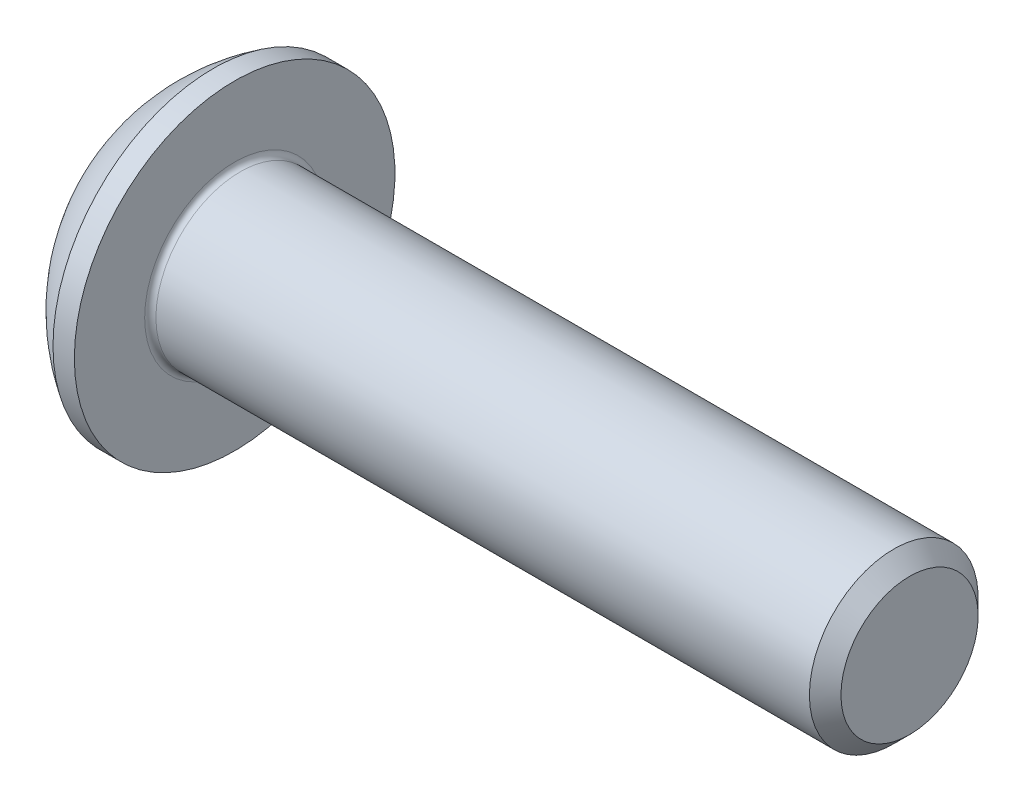
ISO-10303-21;
HEADER;
FILE_DESCRIPTION(('STEP AP214'),'2;1');
FILE_NAME('part.step','',(''),(''),'','','');
FILE_SCHEMA(('AUTOMOTIVE_DESIGN { 1 0 10303 214 1 1 1 1 }'));
ENDSEC;
DATA;
#1=APPLICATION_CONTEXT('core data for automotive mechanical design processes');
#2=APPLICATION_PROTOCOL_DEFINITION('international standard','automotive_design',2000,#1);
#3=PRODUCT_CONTEXT('',#1,'mechanical');
#4=PRODUCT('Part','Part','',(#3));
#5=PRODUCT_RELATED_PRODUCT_CATEGORY('part','',(#4));
#6=PRODUCT_DEFINITION_FORMATION('','',#4);
#7=PRODUCT_DEFINITION_CONTEXT('part definition',#1,'design');
#8=PRODUCT_DEFINITION('design','',#6,#7);
#9=PRODUCT_DEFINITION_SHAPE('','',#8);
#10=(LENGTH_UNIT() NAMED_UNIT(*) SI_UNIT(.MILLI.,.METRE.));
#11=(NAMED_UNIT(*) PLANE_ANGLE_UNIT() SI_UNIT($,.RADIAN.));
#12=(NAMED_UNIT(*) SI_UNIT($,.STERADIAN.) SOLID_ANGLE_UNIT());
#13=UNCERTAINTY_MEASURE_WITH_UNIT(LENGTH_MEASURE(1.E-05),#10,'distance_accuracy_value','');
#14=(GEOMETRIC_REPRESENTATION_CONTEXT(3) GLOBAL_UNCERTAINTY_ASSIGNED_CONTEXT((#13)) GLOBAL_UNIT_ASSIGNED_CONTEXT((#10,
#11,#12)) REPRESENTATION_CONTEXT('',''));
#15=CARTESIAN_POINT('',(0.,0.,0.));
#16=DIRECTION('',(0.,0.,1.));
#17=DIRECTION('',(1.,0.,0.));
#18=AXIS2_PLACEMENT_3D('',#15,#16,#17);
#19=CARTESIAN_POINT('',(0.,0.,0.));
#20=DIRECTION('',(-1.,0.,0.));
#21=DIRECTION('',(0.,0.,1.));
#22=AXIS2_PLACEMENT_3D('',#19,#20,#21);
#23=PLANE('',#22);
#24=CARTESIAN_POINT('',(0.,0.,0.));
#25=DIRECTION('',(-1.,0.,0.));
#26=DIRECTION('',(0.,0.,1.));
#27=AXIS2_PLACEMENT_3D('',#24,#25,#26);
#28=CIRCLE('',#27,1.425);
#29=CARTESIAN_POINT('',(0.,0.,1.425));
#30=VERTEX_POINT('',#29);
#31=EDGE_CURVE('E153',#30,#30,#28,.T.);
#32=ORIENTED_EDGE('',*,*,#31,.T.);
#33=EDGE_LOOP('',(#32));
#34=FACE_BOUND('',#33,.T.);
#35=DIRECTION('',(0.,-1.,0.));
#36=VECTOR('',#35,1.);
#37=CARTESIAN_POINT('',(0.,-0.577350269189625,0.999999999999998));
#38=LINE('',#37,#36);
#39=CARTESIAN_POINT('',(0.,0.577350269189628,1.));
#40=VERTEX_POINT('',#39);
#41=CARTESIAN_POINT('',(0.,-0.577350269189625,0.999999999999998));
#42=VERTEX_POINT('',#41);
#43=EDGE_CURVE('E48',#40,#42,#38,.T.);
#44=ORIENTED_EDGE('',*,*,#43,.T.);
#45=DIRECTION('',(0.,-0.499999999999999,-0.866025403784439));
#46=VECTOR('',#45,1.);
#47=CARTESIAN_POINT('',(0.,-1.15470053837925,0.));
#48=LINE('',#47,#46);
#49=CARTESIAN_POINT('',(0.,-1.15470053837925,0.));
#50=VERTEX_POINT('',#49);
#51=EDGE_CURVE('E273',#42,#50,#48,.T.);
#52=ORIENTED_EDGE('',*,*,#51,.T.);
#53=DIRECTION('',(0.,0.499999999999997,-0.86602540378444));
#54=VECTOR('',#53,1.);
#55=CARTESIAN_POINT('',(0.,-0.577350269189626,-1.));
#56=LINE('',#55,#54);
#57=CARTESIAN_POINT('',(0.,-0.577350269189626,-1.));
#58=VERTEX_POINT('',#57);
#59=EDGE_CURVE('E128',#50,#58,#56,.T.);
#60=ORIENTED_EDGE('',*,*,#59,.T.);
#61=DIRECTION('',(0.,1.,0.));
#62=VECTOR('',#61,1.);
#63=CARTESIAN_POINT('',(0.,0.577350269189628,-1.));
#64=LINE('',#63,#62);
#65=CARTESIAN_POINT('',(0.,0.577350269189628,-1.));
#66=VERTEX_POINT('',#65);
#67=EDGE_CURVE('E276',#58,#66,#64,.T.);
#68=ORIENTED_EDGE('',*,*,#67,.T.);
#69=DIRECTION('',(0.,0.499999999999999,0.866025403784439));
#70=VECTOR('',#69,1.);
#71=CARTESIAN_POINT('',(0.,1.15470053837925,0.));
#72=LINE('',#71,#70);
#73=CARTESIAN_POINT('',(0.,1.15470053837925,0.));
#74=VERTEX_POINT('',#73);
#75=EDGE_CURVE('E278',#66,#74,#72,.T.);
#76=ORIENTED_EDGE('',*,*,#75,.T.);
#77=DIRECTION('',(0.,-0.499999999999998,0.866025403784439));
#78=VECTOR('',#77,1.);
#79=CARTESIAN_POINT('',(0.,0.577350269189628,1.));
#80=LINE('',#79,#78);
#81=EDGE_CURVE('E280',#74,#40,#80,.T.);
#82=ORIENTED_EDGE('',*,*,#81,.T.);
#83=EDGE_LOOP('',(#44,#52,#60,#68,#76,#82));
#84=FACE_BOUND('',#83,.T.);
#85=ADVANCED_FACE('F33',(#34,#84),#23,.T.);
#86=CARTESIAN_POINT('',(3.03337598425198,0.,0.));
#87=DIRECTION('',(-1.,0.,0.));
#88=DIRECTION('',(0.,1.,0.));
#89=AXIS2_PLACEMENT_3D('',#86,#87,#88);
#90=SPHERICAL_SURFACE('',#89,3.35141684393879);
#91=CARTESIAN_POINT('',(1.27,0.,0.));
#92=DIRECTION('',(-1.,0.,0.));
#93=DIRECTION('',(0.,0.,1.));
#94=AXIS2_PLACEMENT_3D('',#91,#92,#93);
#95=CIRCLE('',#94,2.85);
#96=CARTESIAN_POINT('',(1.27,0.,2.85));
#97=VERTEX_POINT('',#96);
#98=EDGE_CURVE('E150',#97,#97,#95,.T.);
#99=ORIENTED_EDGE('',*,*,#98,.T.);
#100=EDGE_LOOP('',(#99));
#101=FACE_BOUND('',#100,.T.);
#102=ORIENTED_EDGE('',*,*,#31,.F.);
#103=EDGE_LOOP('',(#102));
#104=FACE_BOUND('',#103,.T.);
#105=ADVANCED_FACE('F174',(#101,#104),#90,.T.);
#106=CARTESIAN_POINT('',(0.,0.,0.));
#107=DIRECTION('',(-1.,0.,0.));
#108=DIRECTION('',(0.,0.,1.));
#109=AXIS2_PLACEMENT_3D('',#106,#107,#108);
#110=CYLINDRICAL_SURFACE('',#109,2.85);
#111=ORIENTED_EDGE('',*,*,#98,.F.);
#112=EDGE_LOOP('',(#111));
#113=FACE_BOUND('',#112,.T.);
#114=CARTESIAN_POINT('',(1.65,0.,0.));
#115=DIRECTION('',(-1.,0.,0.));
#116=DIRECTION('',(0.,0.,1.));
#117=AXIS2_PLACEMENT_3D('',#114,#115,#116);
#118=CIRCLE('',#117,2.85);
#119=CARTESIAN_POINT('',(1.65,0.,2.85));
#120=VERTEX_POINT('',#119);
#121=EDGE_CURVE('E147',#120,#120,#118,.T.);
#122=ORIENTED_EDGE('',*,*,#121,.T.);
#123=EDGE_LOOP('',(#122));
#124=FACE_BOUND('',#123,.T.);
#125=ADVANCED_FACE('F179',(#113,#124),#110,.T.);
#126=CARTESIAN_POINT('',(1.65,1.49999999999999,0.));
#127=DIRECTION('',(-1.,0.,0.));
#128=DIRECTION('',(0.,0.,1.));
#129=AXIS2_PLACEMENT_3D('',#126,#127,#128);
#130=PLANE('',#129);
#131=CARTESIAN_POINT('',(1.65,0.,0.));
#132=DIRECTION('',(-1.,0.,0.));
#133=DIRECTION('',(0.,0.,1.));
#134=AXIS2_PLACEMENT_3D('',#131,#132,#133);
#135=CIRCLE('',#134,1.6);
#136=CARTESIAN_POINT('',(1.65,0.,1.6));
#137=VERTEX_POINT('',#136);
#138=EDGE_CURVE('E41',#137,#137,#135,.T.);
#139=ORIENTED_EDGE('',*,*,#138,.T.);
#140=EDGE_LOOP('',(#139));
#141=FACE_BOUND('',#140,.T.);
#142=ORIENTED_EDGE('',*,*,#121,.F.);
#143=EDGE_LOOP('',(#142));
#144=FACE_BOUND('',#143,.T.);
#145=ADVANCED_FACE('F158',(#141,#144),#130,.F.);
#146=CARTESIAN_POINT('',(0.,0.,0.));
#147=DIRECTION('',(-1.,0.,0.));
#148=DIRECTION('',(0.,0.,1.));
#149=AXIS2_PLACEMENT_3D('',#146,#147,#148);
#150=CYLINDRICAL_SURFACE('',#149,1.5);
#151=CARTESIAN_POINT('',(1.75,0.,0.));
#152=DIRECTION('',(-1.,0.,0.));
#153=DIRECTION('',(0.,0.,1.));
#154=AXIS2_PLACEMENT_3D('',#151,#152,#153);
#155=CIRCLE('',#154,1.5);
#156=CARTESIAN_POINT('',(1.75,0.,1.5));
#157=VERTEX_POINT('',#156);
#158=EDGE_CURVE('E11',#157,#157,#155,.F.);
#159=ORIENTED_EDGE('',*,*,#158,.T.);
#160=EDGE_LOOP('',(#159));
#161=FACE_BOUND('',#160,.T.);
#162=CARTESIAN_POINT('',(13.3695,0.,0.));
#163=DIRECTION('',(-1.,0.,0.));
#164=DIRECTION('',(0.,0.,1.));
#165=AXIS2_PLACEMENT_3D('',#162,#163,#164);
#166=CIRCLE('',#165,1.5);
#167=CARTESIAN_POINT('',(13.3695,0.,1.5));
#168=VERTEX_POINT('',#167);
#169=EDGE_CURVE('E144',#168,#168,#166,.T.);
#170=ORIENTED_EDGE('',*,*,#169,.T.);
#171=EDGE_LOOP('',(#170));
#172=FACE_BOUND('',#171,.T.);
#173=ADVANCED_FACE('F188',(#161,#172),#150,.T.);
#174=CARTESIAN_POINT('',(13.65,0.,0.));
#175=DIRECTION('',(-1.,0.,0.));
#176=DIRECTION('',(0.,0.,1.));
#177=AXIS2_PLACEMENT_3D('',#174,#175,#176);
#178=CONICAL_SURFACE('',#177,1.2195,0.785398163397445);
#179=ORIENTED_EDGE('',*,*,#169,.F.);
#180=EDGE_LOOP('',(#179));
#181=FACE_BOUND('',#180,.T.);
#182=CARTESIAN_POINT('',(13.65,0.,0.));
#183=DIRECTION('',(-1.,0.,0.));
#184=DIRECTION('',(0.,0.,1.));
#185=AXIS2_PLACEMENT_3D('',#182,#183,#184);
#186=CIRCLE('',#185,1.2195);
#187=CARTESIAN_POINT('',(13.65,0.,1.2195));
#188=VERTEX_POINT('',#187);
#189=EDGE_CURVE('E140',#188,#188,#186,.T.);
#190=ORIENTED_EDGE('',*,*,#189,.T.);
#191=EDGE_LOOP('',(#190));
#192=FACE_BOUND('',#191,.T.);
#193=ADVANCED_FACE('F169',(#181,#192),#178,.T.);
#194=CARTESIAN_POINT('',(13.65,0.,0.));
#195=DIRECTION('',(-1.,0.,0.));
#196=DIRECTION('',(0.,0.,1.));
#197=AXIS2_PLACEMENT_3D('',#194,#195,#196);
#198=PLANE('',#197);
#199=ORIENTED_EDGE('',*,*,#189,.F.);
#200=EDGE_LOOP('',(#199));
#201=FACE_BOUND('',#200,.T.);
#202=ADVANCED_FACE('F162',(#201),#198,.F.);
#203=CARTESIAN_POINT('',(1.75,0.,0.));
#204=DIRECTION('',(-1.,0.,0.));
#205=DIRECTION('',(0.,0.,1.));
#206=AXIS2_PLACEMENT_3D('',#203,#204,#205);
#207=TOROIDAL_SURFACE('',#206,1.6,0.1);
#208=ORIENTED_EDGE('',*,*,#158,.F.);
#209=EDGE_LOOP('',(#208));
#210=FACE_BOUND('',#209,.T.);
#211=ORIENTED_EDGE('',*,*,#138,.F.);
#212=EDGE_LOOP('',(#211));
#213=FACE_BOUND('',#212,.T.);
#214=ADVANCED_FACE('F35',(#210,#213),#207,.F.);
#215=CARTESIAN_POINT('',(1.04,-1.15470053837925,0.));
#216=DIRECTION('',(0.,0.866025403784439,-0.499999999999999));
#217=DIRECTION('',(0.,0.499999999999999,0.866025403784439));
#218=AXIS2_PLACEMENT_3D('',#215,#216,#217);
#219=PLANE('',#218);
#220=DIRECTION('',(0.,-0.499999999999999,-0.866025403784439));
#221=VECTOR('',#220,1.);
#222=CARTESIAN_POINT('',(1.04,-1.15470053837925,0.));
#223=LINE('',#222,#221);
#224=CARTESIAN_POINT('',(1.04,-0.577350269189625,0.999999999999998));
#225=VERTEX_POINT('',#224);
#226=CARTESIAN_POINT('',(1.04,-0.866025403784437,0.499999999999998));
#227=VERTEX_POINT('',#226);
#228=EDGE_CURVE('E114',#225,#227,#223,.T.);
#229=ORIENTED_EDGE('',*,*,#228,.T.);
#230=CARTESIAN_POINT('',(1.04,-1.15470053837925,0.));
#231=VERTEX_POINT('',#230);
#232=EDGE_CURVE('E109',#227,#231,#223,.T.);
#233=ORIENTED_EDGE('',*,*,#232,.T.);
#234=DIRECTION('',(-1.,0.,0.));
#235=VECTOR('',#234,1.);
#236=CARTESIAN_POINT('',(1.04,-1.15470053837925,0.));
#237=LINE('',#236,#235);
#238=EDGE_CURVE('E111',#231,#50,#237,.T.);
#239=ORIENTED_EDGE('',*,*,#238,.T.);
#240=ORIENTED_EDGE('',*,*,#51,.F.);
#241=DIRECTION('',(-1.,0.,0.));
#242=VECTOR('',#241,1.);
#243=CARTESIAN_POINT('',(1.04,-0.577350269189625,0.999999999999998));
#244=LINE('',#243,#242);
#245=EDGE_CURVE('E269',#225,#42,#244,.T.);
#246=ORIENTED_EDGE('',*,*,#245,.F.);
#247=EDGE_LOOP('',(#229,#233,#239,#240,#246));
#248=FACE_BOUND('',#247,.T.);
#249=ADVANCED_FACE('F110',(#248),#219,.T.);
#250=CARTESIAN_POINT('',(1.04,-0.577350269189626,-1.));
#251=DIRECTION('',(0.,0.86602540378444,0.499999999999998));
#252=DIRECTION('',(0.,-0.499999999999998,0.86602540378444));
#253=AXIS2_PLACEMENT_3D('',#250,#251,#252);
#254=PLANE('',#253);
#255=DIRECTION('',(0.,0.499999999999997,-0.86602540378444));
#256=VECTOR('',#255,1.);
#257=CARTESIAN_POINT('',(1.04,-0.577350269189626,-1.));
#258=LINE('',#257,#256);
#259=CARTESIAN_POINT('',(1.04,-0.86602540378444,-0.499999999999997));
#260=VERTEX_POINT('',#259);
#261=EDGE_CURVE('E56',#231,#260,#258,.T.);
#262=ORIENTED_EDGE('',*,*,#261,.T.);
#263=CARTESIAN_POINT('',(1.04,-0.577350269189626,-1.));
#264=VERTEX_POINT('',#263);
#265=EDGE_CURVE('E123',#260,#264,#258,.T.);
#266=ORIENTED_EDGE('',*,*,#265,.T.);
#267=DIRECTION('',(-1.,0.,0.));
#268=VECTOR('',#267,1.);
#269=CARTESIAN_POINT('',(1.04,-0.577350269189626,-1.));
#270=LINE('',#269,#268);
#271=EDGE_CURVE('E130',#264,#58,#270,.T.);
#272=ORIENTED_EDGE('',*,*,#271,.T.);
#273=ORIENTED_EDGE('',*,*,#59,.F.);
#274=ORIENTED_EDGE('',*,*,#238,.F.);
#275=EDGE_LOOP('',(#262,#266,#272,#273,#274));
#276=FACE_BOUND('',#275,.T.);
#277=ADVANCED_FACE('F126',(#276),#254,.T.);
#278=CARTESIAN_POINT('',(1.04,0.577350269189628,-1.));
#279=DIRECTION('',(0.,0.,1.));
#280=DIRECTION('',(1.,0.,0.));
#281=AXIS2_PLACEMENT_3D('',#278,#279,#280);
#282=PLANE('',#281);
#283=DIRECTION('',(0.,1.,0.));
#284=VECTOR('',#283,1.);
#285=CARTESIAN_POINT('',(1.04,0.577350269189628,-1.));
#286=LINE('',#285,#284);
#287=CARTESIAN_POINT('',(1.04,0.,-1.));
#288=VERTEX_POINT('',#287);
#289=EDGE_CURVE('E250',#264,#288,#286,.T.);
#290=ORIENTED_EDGE('',*,*,#289,.T.);
#291=CARTESIAN_POINT('',(1.04,0.577350269189628,-1.));
#292=VERTEX_POINT('',#291);
#293=EDGE_CURVE('E122',#288,#292,#286,.T.);
#294=ORIENTED_EDGE('',*,*,#293,.T.);
#295=DIRECTION('',(-1.,0.,0.));
#296=VECTOR('',#295,1.);
#297=CARTESIAN_POINT('',(1.04,0.577350269189628,-1.));
#298=LINE('',#297,#296);
#299=EDGE_CURVE('E135',#292,#66,#298,.T.);
#300=ORIENTED_EDGE('',*,*,#299,.T.);
#301=ORIENTED_EDGE('',*,*,#67,.F.);
#302=ORIENTED_EDGE('',*,*,#271,.F.);
#303=EDGE_LOOP('',(#290,#294,#300,#301,#302));
#304=FACE_BOUND('',#303,.T.);
#305=ADVANCED_FACE('F202',(#304),#282,.T.);
#306=CARTESIAN_POINT('',(1.04,1.15470053837925,0.));
#307=DIRECTION('',(0.,-0.86602540378444,0.499999999999999));
#308=DIRECTION('',(0.,-0.499999999999999,-0.866025403784439));
#309=AXIS2_PLACEMENT_3D('',#306,#307,#308);
#310=PLANE('',#309);
#311=DIRECTION('',(0.,0.499999999999999,0.866025403784439));
#312=VECTOR('',#311,1.);
#313=CARTESIAN_POINT('',(1.04,1.15470053837925,0.));
#314=LINE('',#313,#312);
#315=CARTESIAN_POINT('',(1.04,0.86602540378444,-0.499999999999999));
#316=VERTEX_POINT('',#315);
#317=EDGE_CURVE('E239',#292,#316,#314,.T.);
#318=ORIENTED_EDGE('',*,*,#317,.T.);
#319=CARTESIAN_POINT('',(1.04,1.15470053837925,0.));
#320=VERTEX_POINT('',#319);
#321=EDGE_CURVE('E244',#316,#320,#314,.T.);
#322=ORIENTED_EDGE('',*,*,#321,.T.);
#323=DIRECTION('',(-1.,0.,0.));
#324=VECTOR('',#323,1.);
#325=CARTESIAN_POINT('',(1.04,1.15470053837925,0.));
#326=LINE('',#325,#324);
#327=EDGE_CURVE('E284',#320,#74,#326,.T.);
#328=ORIENTED_EDGE('',*,*,#327,.T.);
#329=ORIENTED_EDGE('',*,*,#75,.F.);
#330=ORIENTED_EDGE('',*,*,#299,.F.);
#331=EDGE_LOOP('',(#318,#322,#328,#329,#330));
#332=FACE_BOUND('',#331,.T.);
#333=ADVANCED_FACE('F205',(#332),#310,.T.);
#334=CARTESIAN_POINT('',(1.04,0.577350269189628,1.));
#335=DIRECTION('',(0.,-0.86602540378444,-0.499999999999998));
#336=DIRECTION('',(0.,0.499999999999998,-0.86602540378444));
#337=AXIS2_PLACEMENT_3D('',#334,#335,#336);
#338=PLANE('',#337);
#339=DIRECTION('',(0.,-0.499999999999998,0.866025403784439));
#340=VECTOR('',#339,1.);
#341=CARTESIAN_POINT('',(1.04,0.577350269189628,1.));
#342=LINE('',#341,#340);
#343=CARTESIAN_POINT('',(1.04,0.86602540378444,0.499999999999999));
#344=VERTEX_POINT('',#343);
#345=EDGE_CURVE('E247',#320,#344,#342,.T.);
#346=ORIENTED_EDGE('',*,*,#345,.T.);
#347=CARTESIAN_POINT('',(1.04,0.577350269189628,1.));
#348=VERTEX_POINT('',#347);
#349=EDGE_CURVE('E255',#344,#348,#342,.T.);
#350=ORIENTED_EDGE('',*,*,#349,.T.);
#351=DIRECTION('',(-1.,0.,0.));
#352=VECTOR('',#351,1.);
#353=CARTESIAN_POINT('',(1.04,0.577350269189628,1.));
#354=LINE('',#353,#352);
#355=EDGE_CURVE('E268',#348,#40,#354,.T.);
#356=ORIENTED_EDGE('',*,*,#355,.T.);
#357=ORIENTED_EDGE('',*,*,#81,.F.);
#358=ORIENTED_EDGE('',*,*,#327,.F.);
#359=EDGE_LOOP('',(#346,#350,#356,#357,#358));
#360=FACE_BOUND('',#359,.T.);
#361=ADVANCED_FACE('F209',(#360),#338,.T.);
#362=CARTESIAN_POINT('',(1.04,-0.577350269189625,0.999999999999998));
#363=DIRECTION('',(0.,0.,-1.));
#364=DIRECTION('',(0.,1.,0.));
#365=AXIS2_PLACEMENT_3D('',#362,#363,#364);
#366=PLANE('',#365);
#367=DIRECTION('',(0.,-1.,0.));
#368=VECTOR('',#367,1.);
#369=CARTESIAN_POINT('',(1.04,-0.577350269189625,0.999999999999998));
#370=LINE('',#369,#368);
#371=CARTESIAN_POINT('',(1.04,0.,1.));
#372=VERTEX_POINT('',#371);
#373=EDGE_CURVE('E261',#348,#372,#370,.T.);
#374=ORIENTED_EDGE('',*,*,#373,.T.);
#375=EDGE_CURVE('E263',#372,#225,#370,.T.);
#376=ORIENTED_EDGE('',*,*,#375,.T.);
#377=ORIENTED_EDGE('',*,*,#245,.T.);
#378=ORIENTED_EDGE('',*,*,#43,.F.);
#379=ORIENTED_EDGE('',*,*,#355,.F.);
#380=EDGE_LOOP('',(#374,#376,#377,#378,#379));
#381=FACE_BOUND('',#380,.T.);
#382=ADVANCED_FACE('F213',(#381),#366,.T.);
#383=CARTESIAN_POINT('',(1.04,-1.73205080756887,-1.));
#384=DIRECTION('',(1.,0.,0.));
#385=DIRECTION('',(0.,0.,-1.));
#386=AXIS2_PLACEMENT_3D('',#383,#384,#385);
#387=PLANE('',#386);
#388=CARTESIAN_POINT('',(1.04,0.,0.));
#389=DIRECTION('',(-1.,0.,0.));
#390=DIRECTION('',(0.,0.,1.));
#391=AXIS2_PLACEMENT_3D('',#388,#389,#390);
#392=CIRCLE('',#391,1.);
#393=EDGE_CURVE('E236',#316,#288,#392,.T.);
#394=ORIENTED_EDGE('',*,*,#393,.F.);
#395=ORIENTED_EDGE('',*,*,#317,.F.);
#396=ORIENTED_EDGE('',*,*,#293,.F.);
#397=EDGE_LOOP('',(#394,#395,#396));
#398=FACE_BOUND('',#397,.T.);
#399=ADVANCED_FACE('F217',(#398),#387,.F.);
#400=EDGE_CURVE('E141',#344,#316,#392,.T.);
#401=ORIENTED_EDGE('',*,*,#400,.F.);
#402=ORIENTED_EDGE('',*,*,#345,.F.);
#403=ORIENTED_EDGE('',*,*,#321,.F.);
#404=EDGE_LOOP('',(#401,#402,#403));
#405=FACE_BOUND('',#404,.T.);
#406=ADVANCED_FACE('F226',(#405),#387,.F.);
#407=EDGE_CURVE('E134',#372,#344,#392,.T.);
#408=ORIENTED_EDGE('',*,*,#407,.F.);
#409=ORIENTED_EDGE('',*,*,#373,.F.);
#410=ORIENTED_EDGE('',*,*,#349,.F.);
#411=EDGE_LOOP('',(#408,#409,#410));
#412=FACE_BOUND('',#411,.T.);
#413=ADVANCED_FACE('F231',(#412),#387,.F.);
#414=EDGE_CURVE('E129',#227,#372,#392,.T.);
#415=ORIENTED_EDGE('',*,*,#414,.F.);
#416=ORIENTED_EDGE('',*,*,#228,.F.);
#417=ORIENTED_EDGE('',*,*,#375,.F.);
#418=EDGE_LOOP('',(#415,#416,#417));
#419=FACE_BOUND('',#418,.T.);
#420=ADVANCED_FACE('F224',(#419),#387,.F.);
#421=EDGE_CURVE('E120',#260,#227,#392,.T.);
#422=ORIENTED_EDGE('',*,*,#421,.F.);
#423=ORIENTED_EDGE('',*,*,#261,.F.);
#424=ORIENTED_EDGE('',*,*,#232,.F.);
#425=EDGE_LOOP('',(#422,#423,#424));
#426=FACE_BOUND('',#425,.T.);
#427=ADVANCED_FACE('F119',(#426),#387,.F.);
#428=EDGE_CURVE('E242',#288,#260,#392,.T.);
#429=ORIENTED_EDGE('',*,*,#428,.F.);
#430=ORIENTED_EDGE('',*,*,#289,.F.);
#431=ORIENTED_EDGE('',*,*,#265,.F.);
#432=EDGE_LOOP('',(#429,#430,#431));
#433=FACE_BOUND('',#432,.T.);
#434=ADVANCED_FACE('F197',(#433),#387,.F.);
#435=CARTESIAN_POINT('',(1.61735026918963,0.,0.));
#436=DIRECTION('',(-1.,0.,0.));
#437=DIRECTION('',(0.,0.,1.));
#438=AXIS2_PLACEMENT_3D('',#435,#436,#437);
#439=CONICAL_SURFACE('',#438,0.,1.04719755119659);
#440=ORIENTED_EDGE('',*,*,#407,.T.);
#441=ORIENTED_EDGE('',*,*,#400,.T.);
#442=ORIENTED_EDGE('',*,*,#393,.T.);
#443=ORIENTED_EDGE('',*,*,#428,.T.);
#444=ORIENTED_EDGE('',*,*,#421,.T.);
#445=ORIENTED_EDGE('',*,*,#414,.T.);
#446=EDGE_LOOP('',(#440,#441,#442,#443,#444,#445));
#447=FACE_BOUND('',#446,.T.);
#448=CARTESIAN_POINT('',(1.61735026918963,0.,0.));
#449=VERTEX_POINT('',#448);
#450=VERTEX_LOOP('',#449);
#451=FACE_BOUND('',#450,.T.);
#452=ADVANCED_FACE('F195',(#447,#451),#439,.F.);
#453=CLOSED_SHELL('',(#85,#105,#125,#145,#173,#193,#202,#214,#249,#277,#305,#333,#361,#382,#399,
#406,#413,#420,#427,#434,#452));
#454=MANIFOLD_SOLID_BREP('B2',#453);
#455=ADVANCED_BREP_SHAPE_REPRESENTATION('',(#18,#454),#14);
#456=SHAPE_DEFINITION_REPRESENTATION(#9,#455);
ENDSEC;
END-ISO-10303-21;
